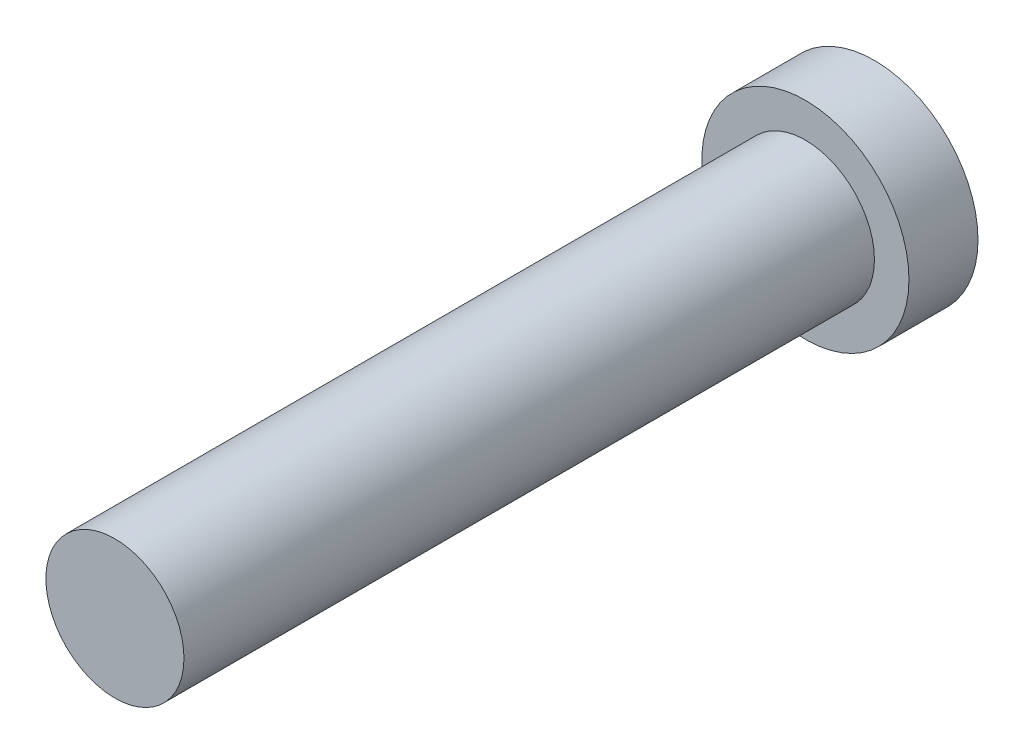
ISO-10303-21;
HEADER;
FILE_DESCRIPTION(('STEP AP214'),'2;1');
FILE_NAME('part.step','',(''),(''),'','','');
FILE_SCHEMA(('AUTOMOTIVE_DESIGN { 1 0 10303 214 1 1 1 1 }'));
ENDSEC;
DATA;
#1=APPLICATION_CONTEXT('core data for automotive mechanical design processes');
#2=APPLICATION_PROTOCOL_DEFINITION('international standard','automotive_design',2000,#1);
#3=PRODUCT_CONTEXT('',#1,'mechanical');
#4=PRODUCT('Part','Part','',(#3));
#5=PRODUCT_RELATED_PRODUCT_CATEGORY('part','',(#4));
#6=PRODUCT_DEFINITION_FORMATION('','',#4);
#7=PRODUCT_DEFINITION_CONTEXT('part definition',#1,'design');
#8=PRODUCT_DEFINITION('design','',#6,#7);
#9=PRODUCT_DEFINITION_SHAPE('','',#8);
#10=(LENGTH_UNIT() NAMED_UNIT(*) SI_UNIT(.MILLI.,.METRE.));
#11=(NAMED_UNIT(*) PLANE_ANGLE_UNIT() SI_UNIT($,.RADIAN.));
#12=(NAMED_UNIT(*) SI_UNIT($,.STERADIAN.) SOLID_ANGLE_UNIT());
#13=UNCERTAINTY_MEASURE_WITH_UNIT(LENGTH_MEASURE(1.E-05),#10,'distance_accuracy_value','');
#14=(GEOMETRIC_REPRESENTATION_CONTEXT(3) GLOBAL_UNCERTAINTY_ASSIGNED_CONTEXT((#13)) GLOBAL_UNIT_ASSIGNED_CONTEXT((#10,
#11,#12)) REPRESENTATION_CONTEXT('',''));
#15=CARTESIAN_POINT('',(0.,0.,0.));
#16=DIRECTION('',(0.,0.,1.));
#17=DIRECTION('',(1.,0.,0.));
#18=AXIS2_PLACEMENT_3D('',#15,#16,#17);
#19=CARTESIAN_POINT('',(0.,0.,2.54));
#20=DIRECTION('',(0.,0.,-1.));
#21=DIRECTION('',(-1.,0.,0.));
#22=AXIS2_PLACEMENT_3D('',#19,#20,#21);
#23=CYLINDRICAL_SURFACE('',#22,3.81);
#24=CARTESIAN_POINT('',(0.,0.,2.54));
#25=DIRECTION('',(0.,0.,1.));
#26=DIRECTION('',(1.,0.,0.));
#27=AXIS2_PLACEMENT_3D('',#24,#25,#26);
#28=CIRCLE('',#27,3.81);
#29=CARTESIAN_POINT('',(3.81,0.,2.54));
#30=VERTEX_POINT('',#29);
#31=EDGE_CURVE('E10',#30,#30,#28,.T.);
#32=ORIENTED_EDGE('',*,*,#31,.F.);
#33=EDGE_LOOP('',(#32));
#34=FACE_BOUND('',#33,.T.);
#35=CARTESIAN_POINT('',(0.,0.,0.));
#36=DIRECTION('',(0.,0.,1.));
#37=DIRECTION('',(1.,0.,0.));
#38=AXIS2_PLACEMENT_3D('',#35,#36,#37);
#39=CIRCLE('',#38,3.81);
#40=CARTESIAN_POINT('',(3.81,0.,0.));
#41=VERTEX_POINT('',#40);
#42=EDGE_CURVE('E34',#41,#41,#39,.T.);
#43=ORIENTED_EDGE('',*,*,#42,.T.);
#44=EDGE_LOOP('',(#43));
#45=FACE_BOUND('',#44,.T.);
#46=ADVANCED_FACE('F31',(#34,#45),#23,.T.);
#47=CARTESIAN_POINT('',(0.,0.,2.54));
#48=DIRECTION('',(0.,0.,1.));
#49=DIRECTION('',(1.,0.,0.));
#50=AXIS2_PLACEMENT_3D('',#47,#48,#49);
#51=PLANE('',#50);
#52=CARTESIAN_POINT('',(0.,0.,2.54));
#53=DIRECTION('',(0.,0.,1.));
#54=DIRECTION('',(1.,0.,0.));
#55=AXIS2_PLACEMENT_3D('',#52,#53,#54);
#56=CIRCLE('',#55,2.54);
#57=CARTESIAN_POINT('',(2.54,0.,2.54));
#58=VERTEX_POINT('',#57);
#59=EDGE_CURVE('E43',#58,#58,#56,.T.);
#60=ORIENTED_EDGE('',*,*,#59,.F.);
#61=EDGE_LOOP('',(#60));
#62=FACE_BOUND('',#61,.T.);
#63=ORIENTED_EDGE('',*,*,#31,.T.);
#64=EDGE_LOOP('',(#63));
#65=FACE_BOUND('',#64,.T.);
#66=ADVANCED_FACE('F58',(#62,#65),#51,.T.);
#67=CARTESIAN_POINT('',(0.,0.,0.));
#68=DIRECTION('',(0.,0.,1.));
#69=DIRECTION('',(1.,0.,0.));
#70=AXIS2_PLACEMENT_3D('',#67,#68,#69);
#71=PLANE('',#70);
#72=ORIENTED_EDGE('',*,*,#42,.F.);
#73=EDGE_LOOP('',(#72));
#74=FACE_BOUND('',#73,.T.);
#75=ADVANCED_FACE('F54',(#74),#71,.F.);
#76=CARTESIAN_POINT('',(0.,0.,27.94));
#77=DIRECTION('',(0.,0.,-1.));
#78=DIRECTION('',(-1.,0.,0.));
#79=AXIS2_PLACEMENT_3D('',#76,#77,#78);
#80=CYLINDRICAL_SURFACE('',#79,2.54);
#81=CARTESIAN_POINT('',(0.,0.,27.94));
#82=DIRECTION('',(0.,0.,1.));
#83=DIRECTION('',(1.,0.,0.));
#84=AXIS2_PLACEMENT_3D('',#81,#82,#83);
#85=CIRCLE('',#84,2.54);
#86=CARTESIAN_POINT('',(2.54,0.,27.94));
#87=VERTEX_POINT('',#86);
#88=EDGE_CURVE('E41',#87,#87,#85,.T.);
#89=ORIENTED_EDGE('',*,*,#88,.F.);
#90=EDGE_LOOP('',(#89));
#91=FACE_BOUND('',#90,.T.);
#92=ORIENTED_EDGE('',*,*,#59,.T.);
#93=EDGE_LOOP('',(#92));
#94=FACE_BOUND('',#93,.T.);
#95=ADVANCED_FACE('F51',(#91,#94),#80,.T.);
#96=CARTESIAN_POINT('',(0.,0.,27.94));
#97=DIRECTION('',(0.,0.,1.));
#98=DIRECTION('',(1.,0.,0.));
#99=AXIS2_PLACEMENT_3D('',#96,#97,#98);
#100=PLANE('',#99);
#101=ORIENTED_EDGE('',*,*,#88,.T.);
#102=EDGE_LOOP('',(#101));
#103=FACE_BOUND('',#102,.T.);
#104=ADVANCED_FACE('F49',(#103),#100,.T.);
#105=CLOSED_SHELL('',(#46,#66,#75,#95,#104));
#106=MANIFOLD_SOLID_BREP('B2',#105);
#107=ADVANCED_BREP_SHAPE_REPRESENTATION('',(#18,#106),#14);
#108=SHAPE_DEFINITION_REPRESENTATION(#9,#107);
ENDSEC;
END-ISO-10303-21;
